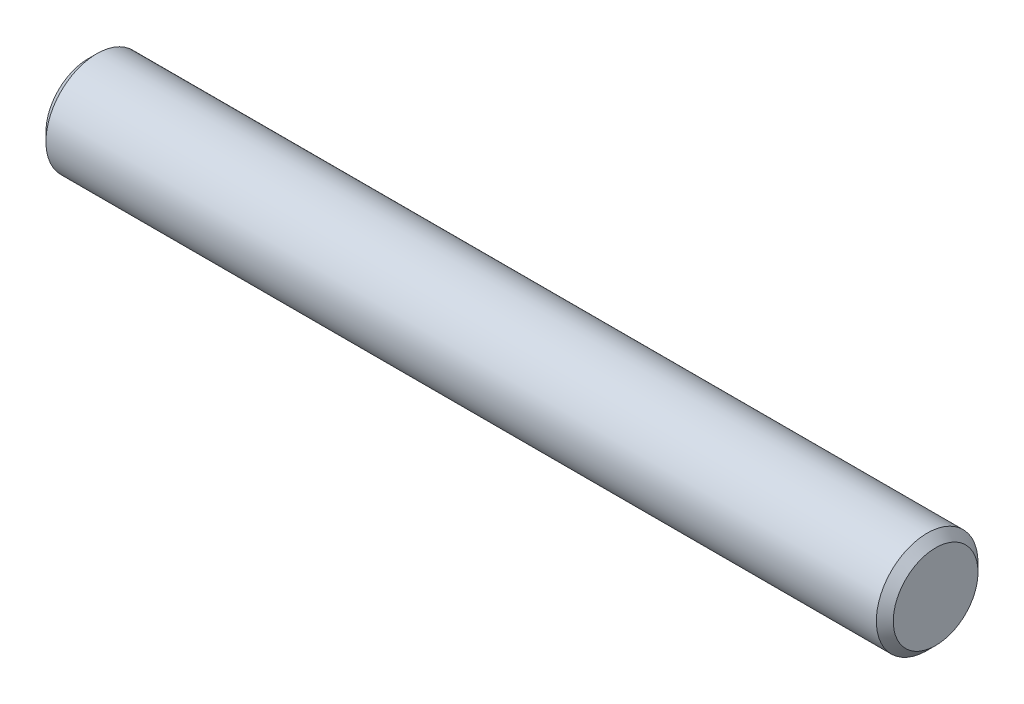
ISO-10303-21;
HEADER;
FILE_DESCRIPTION(('STEP AP214'),'2;1');
FILE_NAME('part.step','',(''),(''),'','','');
FILE_SCHEMA(('AUTOMOTIVE_DESIGN { 1 0 10303 214 1 1 1 1 }'));
ENDSEC;
DATA;
#1=APPLICATION_CONTEXT('core data for automotive mechanical design processes');
#2=APPLICATION_PROTOCOL_DEFINITION('international standard','automotive_design',2000,#1);
#3=PRODUCT_CONTEXT('',#1,'mechanical');
#4=PRODUCT('Part','Part','',(#3));
#5=PRODUCT_RELATED_PRODUCT_CATEGORY('part','',(#4));
#6=PRODUCT_DEFINITION_FORMATION('','',#4);
#7=PRODUCT_DEFINITION_CONTEXT('part definition',#1,'design');
#8=PRODUCT_DEFINITION('design','',#6,#7);
#9=PRODUCT_DEFINITION_SHAPE('','',#8);
#10=(LENGTH_UNIT() NAMED_UNIT(*) SI_UNIT(.MILLI.,.METRE.));
#11=(NAMED_UNIT(*) PLANE_ANGLE_UNIT() SI_UNIT($,.RADIAN.));
#12=(NAMED_UNIT(*) SI_UNIT($,.STERADIAN.) SOLID_ANGLE_UNIT());
#13=UNCERTAINTY_MEASURE_WITH_UNIT(LENGTH_MEASURE(1.E-05),#10,'distance_accuracy_value','');
#14=(GEOMETRIC_REPRESENTATION_CONTEXT(3) GLOBAL_UNCERTAINTY_ASSIGNED_CONTEXT((#13)) GLOBAL_UNIT_ASSIGNED_CONTEXT((#10,
#11,#12)) REPRESENTATION_CONTEXT('',''));
#15=CARTESIAN_POINT('',(0.,0.,0.));
#16=DIRECTION('',(0.,0.,1.));
#17=DIRECTION('',(1.,0.,0.));
#18=AXIS2_PLACEMENT_3D('',#15,#16,#17);
#19=CARTESIAN_POINT('',(50.,0.,0.));
#20=DIRECTION('',(-1.,0.,0.));
#21=DIRECTION('',(0.,0.,1.));
#22=AXIS2_PLACEMENT_3D('',#19,#20,#21);
#23=CYLINDRICAL_SURFACE('',#22,3.);
#24=CARTESIAN_POINT('',(0.49999999999998,0.,0.));
#25=DIRECTION('',(1.,0.,0.));
#26=DIRECTION('',(0.,0.,-1.));
#27=AXIS2_PLACEMENT_3D('',#24,#25,#26);
#28=CIRCLE('',#27,3.);
#29=CARTESIAN_POINT('',(0.49999999999998,0.,-3.));
#30=VERTEX_POINT('',#29);
#31=EDGE_CURVE('E40',#30,#30,#28,.T.);
#32=ORIENTED_EDGE('',*,*,#31,.T.);
#33=EDGE_LOOP('',(#32));
#34=FACE_BOUND('',#33,.T.);
#35=CARTESIAN_POINT('',(49.5,0.,0.));
#36=DIRECTION('',(1.,0.,0.));
#37=DIRECTION('',(0.,0.,-1.));
#38=AXIS2_PLACEMENT_3D('',#35,#36,#37);
#39=CIRCLE('',#38,3.);
#40=CARTESIAN_POINT('',(49.5,0.,-3.));
#41=VERTEX_POINT('',#40);
#42=EDGE_CURVE('E44',#41,#41,#39,.F.);
#43=ORIENTED_EDGE('',*,*,#42,.T.);
#44=EDGE_LOOP('',(#43));
#45=FACE_BOUND('',#44,.T.);
#46=ADVANCED_FACE('F29',(#34,#45),#23,.T.);
#47=CARTESIAN_POINT('',(50.,0.,0.));
#48=DIRECTION('',(1.,0.,0.));
#49=DIRECTION('',(0.,0.,-1.));
#50=AXIS2_PLACEMENT_3D('',#47,#48,#49);
#51=PLANE('',#50);
#52=CARTESIAN_POINT('',(50.,0.,0.));
#53=DIRECTION('',(1.,0.,0.));
#54=DIRECTION('',(0.,0.,-1.));
#55=AXIS2_PLACEMENT_3D('',#52,#53,#54);
#56=CIRCLE('',#55,2.5);
#57=CARTESIAN_POINT('',(50.,0.,-2.5));
#58=VERTEX_POINT('',#57);
#59=EDGE_CURVE('E10',#58,#58,#56,.T.);
#60=ORIENTED_EDGE('',*,*,#59,.T.);
#61=EDGE_LOOP('',(#60));
#62=FACE_BOUND('',#61,.T.);
#63=ADVANCED_FACE('F60',(#62),#51,.T.);
#64=CARTESIAN_POINT('',(0.,0.,0.));
#65=DIRECTION('',(1.,0.,0.));
#66=DIRECTION('',(0.,0.,-1.));
#67=AXIS2_PLACEMENT_3D('',#64,#65,#66);
#68=PLANE('',#67);
#69=CARTESIAN_POINT('',(0.,0.,0.));
#70=DIRECTION('',(1.,0.,0.));
#71=DIRECTION('',(0.,0.,-1.));
#72=AXIS2_PLACEMENT_3D('',#69,#70,#71);
#73=CIRCLE('',#72,2.50000000000002);
#74=CARTESIAN_POINT('',(0.,0.,-2.50000000000002));
#75=VERTEX_POINT('',#74);
#76=EDGE_CURVE('E36',#75,#75,#73,.F.);
#77=ORIENTED_EDGE('',*,*,#76,.T.);
#78=EDGE_LOOP('',(#77));
#79=FACE_BOUND('',#78,.T.);
#80=ADVANCED_FACE('F57',(#79),#68,.F.);
#81=CARTESIAN_POINT('',(0.49999999999998,0.,0.));
#82=DIRECTION('',(1.,0.,0.));
#83=DIRECTION('',(0.,0.,-1.));
#84=AXIS2_PLACEMENT_3D('',#81,#82,#83);
#85=CONICAL_SURFACE('',#84,3.,0.785398163397452);
#86=ORIENTED_EDGE('',*,*,#76,.F.);
#87=EDGE_LOOP('',(#86));
#88=FACE_BOUND('',#87,.T.);
#89=ORIENTED_EDGE('',*,*,#31,.F.);
#90=EDGE_LOOP('',(#89));
#91=FACE_BOUND('',#90,.T.);
#92=ADVANCED_FACE('F53',(#88,#91),#85,.T.);
#93=CARTESIAN_POINT('',(50.,0.,0.));
#94=DIRECTION('',(-1.,0.,0.));
#95=DIRECTION('',(0.,0.,1.));
#96=AXIS2_PLACEMENT_3D('',#93,#94,#95);
#97=CONICAL_SURFACE('',#96,2.5,0.785398163397445);
#98=ORIENTED_EDGE('',*,*,#42,.F.);
#99=EDGE_LOOP('',(#98));
#100=FACE_BOUND('',#99,.T.);
#101=ORIENTED_EDGE('',*,*,#59,.F.);
#102=EDGE_LOOP('',(#101));
#103=FACE_BOUND('',#102,.T.);
#104=ADVANCED_FACE('F31',(#100,#103),#97,.T.);
#105=CLOSED_SHELL('',(#46,#63,#80,#92,#104));
#106=MANIFOLD_SOLID_BREP('B2',#105);
#107=ADVANCED_BREP_SHAPE_REPRESENTATION('',(#18,#106),#14);
#108=SHAPE_DEFINITION_REPRESENTATION(#9,#107);
ENDSEC;
END-ISO-10303-21;
